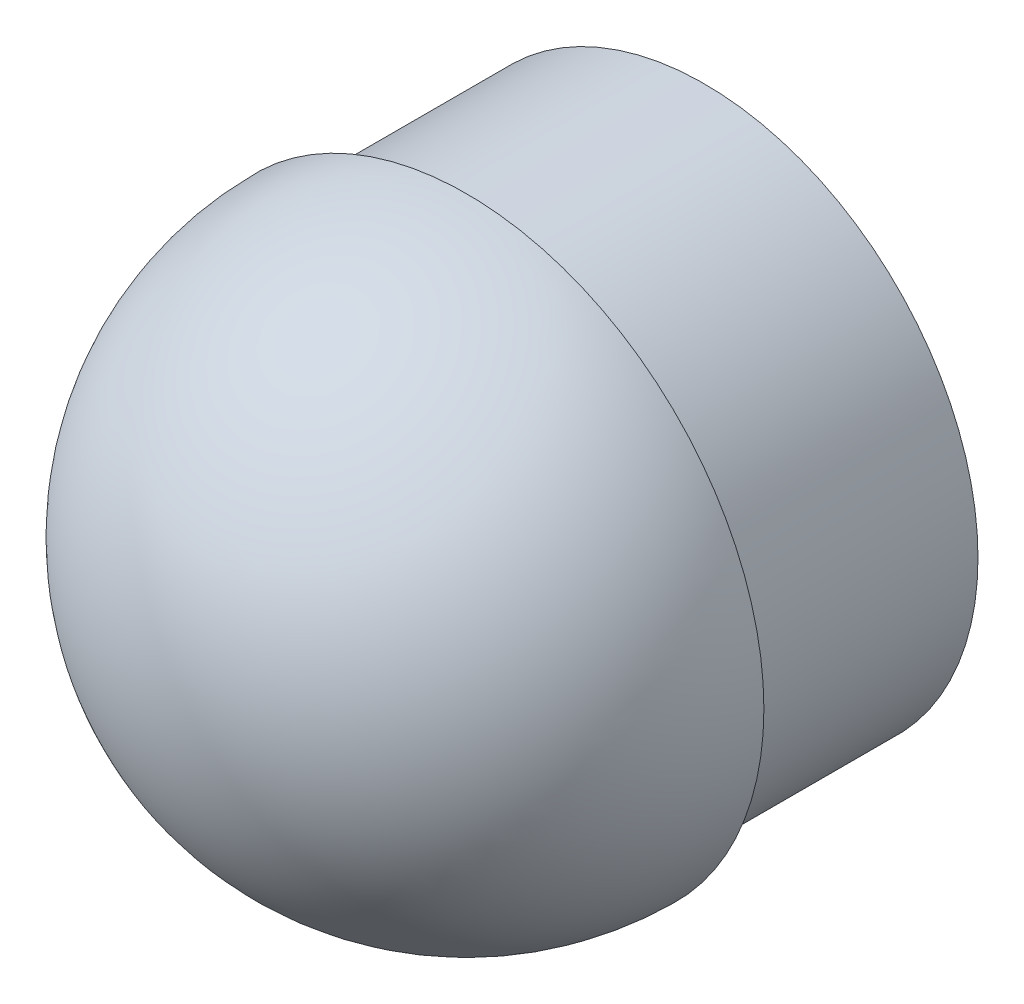
ISO-10303-21;
HEADER;
FILE_DESCRIPTION(('STEP AP214'),'2;1');
FILE_NAME('part.step','',(''),(''),'','','');
FILE_SCHEMA(('AUTOMOTIVE_DESIGN { 1 0 10303 214 1 1 1 1 }'));
ENDSEC;
DATA;
#1=APPLICATION_CONTEXT('core data for automotive mechanical design processes');
#2=APPLICATION_PROTOCOL_DEFINITION('international standard','automotive_design',2000,#1);
#3=PRODUCT_CONTEXT('',#1,'mechanical');
#4=PRODUCT('Part','Part','',(#3));
#5=PRODUCT_RELATED_PRODUCT_CATEGORY('part','',(#4));
#6=PRODUCT_DEFINITION_FORMATION('','',#4);
#7=PRODUCT_DEFINITION_CONTEXT('part definition',#1,'design');
#8=PRODUCT_DEFINITION('design','',#6,#7);
#9=PRODUCT_DEFINITION_SHAPE('','',#8);
#10=(LENGTH_UNIT() NAMED_UNIT(*) SI_UNIT(.MILLI.,.METRE.));
#11=(NAMED_UNIT(*) PLANE_ANGLE_UNIT() SI_UNIT($,.RADIAN.));
#12=(NAMED_UNIT(*) SI_UNIT($,.STERADIAN.) SOLID_ANGLE_UNIT());
#13=UNCERTAINTY_MEASURE_WITH_UNIT(LENGTH_MEASURE(1.E-05),#10,'distance_accuracy_value','');
#14=(GEOMETRIC_REPRESENTATION_CONTEXT(3) GLOBAL_UNCERTAINTY_ASSIGNED_CONTEXT((#13)) GLOBAL_UNIT_ASSIGNED_CONTEXT((#10,
#11,#12)) REPRESENTATION_CONTEXT('',''));
#15=CARTESIAN_POINT('',(0.,0.,0.));
#16=DIRECTION('',(0.,0.,1.));
#17=DIRECTION('',(1.,0.,0.));
#18=AXIS2_PLACEMENT_3D('',#15,#16,#17);
#19=CARTESIAN_POINT('',(0.,0.,10.));
#20=DIRECTION('',(0.,0.,-1.));
#21=DIRECTION('',(-1.,0.,0.));
#22=AXIS2_PLACEMENT_3D('',#19,#20,#21);
#23=CYLINDRICAL_SURFACE('',#22,11.5);
#24=CARTESIAN_POINT('',(0.,0.,10.));
#25=DIRECTION('',(0.,0.,1.));
#26=DIRECTION('',(1.,0.,0.));
#27=AXIS2_PLACEMENT_3D('',#24,#25,#26);
#28=CIRCLE('',#27,11.5);
#29=CARTESIAN_POINT('',(11.5,0.,10.));
#30=VERTEX_POINT('',#29);
#31=EDGE_CURVE('E10',#30,#30,#28,.T.);
#32=ORIENTED_EDGE('',*,*,#31,.F.);
#33=EDGE_LOOP('',(#32));
#34=FACE_BOUND('',#33,.T.);
#35=CARTESIAN_POINT('',(0.,0.,0.));
#36=DIRECTION('',(0.,0.,1.));
#37=DIRECTION('',(1.,0.,0.));
#38=AXIS2_PLACEMENT_3D('',#35,#36,#37);
#39=CIRCLE('',#38,11.5);
#40=CARTESIAN_POINT('',(11.5,0.,0.));
#41=VERTEX_POINT('',#40);
#42=EDGE_CURVE('E36',#41,#41,#39,.T.);
#43=ORIENTED_EDGE('',*,*,#42,.T.);
#44=EDGE_LOOP('',(#43));
#45=FACE_BOUND('',#44,.T.);
#46=ADVANCED_FACE('F32',(#34,#45),#23,.T.);
#47=CARTESIAN_POINT('',(0.,0.,0.));
#48=DIRECTION('',(0.,0.,1.));
#49=DIRECTION('',(1.,0.,0.));
#50=AXIS2_PLACEMENT_3D('',#47,#48,#49);
#51=PLANE('',#50);
#52=ORIENTED_EDGE('',*,*,#42,.F.);
#53=EDGE_LOOP('',(#52));
#54=FACE_BOUND('',#53,.T.);
#55=ADVANCED_FACE('F51',(#54),#51,.F.);
#56=CARTESIAN_POINT('',(0.,0.,10.));
#57=DIRECTION('',(0.,0.,1.));
#58=DIRECTION('',(1.,0.,0.));
#59=AXIS2_PLACEMENT_3D('',#56,#57,#58);
#60=PLANE('',#59);
#61=ORIENTED_EDGE('',*,*,#31,.T.);
#62=EDGE_LOOP('',(#61));
#63=FACE_BOUND('',#62,.T.);
#64=CARTESIAN_POINT('',(0.,0.,10.));
#65=DIRECTION('',(0.,0.,1.));
#66=DIRECTION('',(1.,0.,0.));
#67=AXIS2_PLACEMENT_3D('',#64,#65,#66);
#68=CIRCLE('',#67,12.5);
#69=CARTESIAN_POINT('',(12.5,0.,10.));
#70=VERTEX_POINT('',#69);
#71=EDGE_CURVE('E43',#70,#70,#68,.T.);
#72=ORIENTED_EDGE('',*,*,#71,.F.);
#73=EDGE_LOOP('',(#72));
#74=FACE_BOUND('',#73,.T.);
#75=ADVANCED_FACE('F49',(#63,#74),#60,.F.);
#76=CARTESIAN_POINT('',(0.,0.,10.));
#77=DIRECTION('',(0.,0.,1.));
#78=DIRECTION('',(1.,0.,0.));
#79=AXIS2_PLACEMENT_3D('',#76,#77,#78);
#80=SPHERICAL_SURFACE('',#79,12.5);
#81=ORIENTED_EDGE('',*,*,#71,.T.);
#82=EDGE_LOOP('',(#81));
#83=FACE_BOUND('',#82,.T.);
#84=ADVANCED_FACE('F34',(#83),#80,.T.);
#85=CLOSED_SHELL('',(#46,#55,#75,#84));
#86=MANIFOLD_SOLID_BREP('B2',#85);
#87=ADVANCED_BREP_SHAPE_REPRESENTATION('',(#18,#86),#14);
#88=SHAPE_DEFINITION_REPRESENTATION(#9,#87);
ENDSEC;
END-ISO-10303-21;
